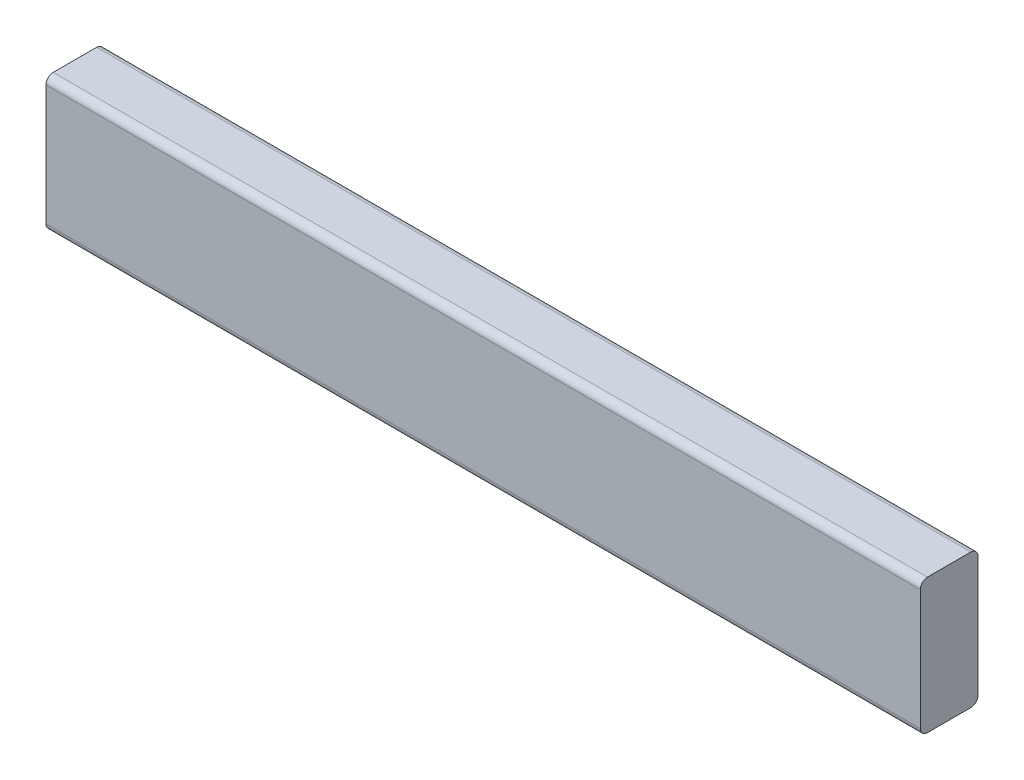
ISO-10303-21;
HEADER;
FILE_DESCRIPTION(('STEP AP214'),'2;1');
FILE_NAME('part.step','',(''),(''),'','','');
FILE_SCHEMA(('AUTOMOTIVE_DESIGN { 1 0 10303 214 1 1 1 1 }'));
ENDSEC;
DATA;
#1=APPLICATION_CONTEXT('core data for automotive mechanical design processes');
#2=APPLICATION_PROTOCOL_DEFINITION('international standard','automotive_design',2000,#1);
#3=PRODUCT_CONTEXT('',#1,'mechanical');
#4=PRODUCT('Part','Part','',(#3));
#5=PRODUCT_RELATED_PRODUCT_CATEGORY('part','',(#4));
#6=PRODUCT_DEFINITION_FORMATION('','',#4);
#7=PRODUCT_DEFINITION_CONTEXT('part definition',#1,'design');
#8=PRODUCT_DEFINITION('design','',#6,#7);
#9=PRODUCT_DEFINITION_SHAPE('','',#8);
#10=(LENGTH_UNIT() NAMED_UNIT(*) SI_UNIT(.MILLI.,.METRE.));
#11=(NAMED_UNIT(*) PLANE_ANGLE_UNIT() SI_UNIT($,.RADIAN.));
#12=(NAMED_UNIT(*) SI_UNIT($,.STERADIAN.) SOLID_ANGLE_UNIT());
#13=UNCERTAINTY_MEASURE_WITH_UNIT(LENGTH_MEASURE(1.E-05),#10,'distance_accuracy_value','');
#14=(GEOMETRIC_REPRESENTATION_CONTEXT(3) GLOBAL_UNCERTAINTY_ASSIGNED_CONTEXT((#13)) GLOBAL_UNIT_ASSIGNED_CONTEXT((#10,
#11,#12)) REPRESENTATION_CONTEXT('',''));
#15=CARTESIAN_POINT('',(0.,0.,0.));
#16=DIRECTION('',(0.,0.,1.));
#17=DIRECTION('',(1.,0.,0.));
#18=AXIS2_PLACEMENT_3D('',#15,#16,#17);
#19=CARTESIAN_POINT('',(-781.730594650988,88.9,-621.709126043838));
#20=DIRECTION('',(-1.,0.,0.));
#21=DIRECTION('',(0.,0.,1.));
#22=AXIS2_PLACEMENT_3D('',#19,#20,#21);
#23=PLANE('',#22);
#24=DIRECTION('',(0.,1.,0.));
#25=VECTOR('',#24,1.);
#26=CARTESIAN_POINT('',(-781.730594651,88.8999999999999,-38.1000000000004));
#27=LINE('',#26,#25);
#28=CARTESIAN_POINT('',(-781.730594651,4.7625,-38.1000000000004));
#29=VERTEX_POINT('',#28);
#30=CARTESIAN_POINT('',(-781.730594651,84.1375,-38.1000000000004));
#31=VERTEX_POINT('',#30);
#32=EDGE_CURVE('E125',#29,#31,#27,.T.);
#33=ORIENTED_EDGE('',*,*,#32,.F.);
#34=CARTESIAN_POINT('',(-781.730594651,4.7625,-33.3375000000003));
#35=DIRECTION('',(-1.,0.,0.));
#36=DIRECTION('',(0.,0.,1.));
#37=AXIS2_PLACEMENT_3D('',#34,#35,#36);
#38=CIRCLE('',#37,4.7625);
#39=CARTESIAN_POINT('',(-781.730594651,0.,-33.3375000000004));
#40=VERTEX_POINT('',#39);
#41=EDGE_CURVE('E106',#29,#40,#38,.T.);
#42=ORIENTED_EDGE('',*,*,#41,.T.);
#43=DIRECTION('',(0.,0.,1.));
#44=VECTOR('',#43,1.);
#45=CARTESIAN_POINT('',(-781.730594650988,0.,-621.709126043838));
#46=LINE('',#45,#44);
#47=CARTESIAN_POINT('',(-781.730594651,0.,-4.7625));
#48=VERTEX_POINT('',#47);
#49=EDGE_CURVE('E152',#40,#48,#46,.T.);
#50=ORIENTED_EDGE('',*,*,#49,.T.);
#51=CARTESIAN_POINT('',(-781.730594651,4.7625,-4.7625));
#52=DIRECTION('',(-1.,0.,0.));
#53=DIRECTION('',(0.,0.,1.));
#54=AXIS2_PLACEMENT_3D('',#51,#52,#53);
#55=CIRCLE('',#54,4.7625);
#56=CARTESIAN_POINT('',(-781.730594651,4.7625,0.));
#57=VERTEX_POINT('',#56);
#58=EDGE_CURVE('E118',#48,#57,#55,.T.);
#59=ORIENTED_EDGE('',*,*,#58,.T.);
#60=DIRECTION('',(0.,-1.,0.));
#61=VECTOR('',#60,1.);
#62=CARTESIAN_POINT('',(-781.730594651,88.9,0.));
#63=LINE('',#62,#61);
#64=CARTESIAN_POINT('',(-781.730594651,84.1375,0.));
#65=VERTEX_POINT('',#64);
#66=EDGE_CURVE('E145',#65,#57,#63,.T.);
#67=ORIENTED_EDGE('',*,*,#66,.F.);
#68=CARTESIAN_POINT('',(-781.730594651,84.1375,-4.7625));
#69=DIRECTION('',(-1.,0.,0.));
#70=DIRECTION('',(0.,0.,1.));
#71=AXIS2_PLACEMENT_3D('',#68,#69,#70);
#72=CIRCLE('',#71,4.7625);
#73=CARTESIAN_POINT('',(-781.730594651,88.9,-4.7625));
#74=VERTEX_POINT('',#73);
#75=EDGE_CURVE('E130',#65,#74,#72,.T.);
#76=ORIENTED_EDGE('',*,*,#75,.T.);
#77=DIRECTION('',(0.,0.,1.));
#78=VECTOR('',#77,1.);
#79=CARTESIAN_POINT('',(-781.730594650988,88.9,-621.709126043838));
#80=LINE('',#79,#78);
#81=CARTESIAN_POINT('',(-781.730594651,88.9,-33.3375000000004));
#82=VERTEX_POINT('',#81);
#83=EDGE_CURVE('E142',#82,#74,#80,.T.);
#84=ORIENTED_EDGE('',*,*,#83,.F.);
#85=CARTESIAN_POINT('',(-781.730594651,84.1375,-33.3375000000003));
#86=DIRECTION('',(-1.,0.,0.));
#87=DIRECTION('',(0.,0.,1.));
#88=AXIS2_PLACEMENT_3D('',#85,#86,#87);
#89=CIRCLE('',#88,4.7625);
#90=EDGE_CURVE('E135',#82,#31,#89,.T.);
#91=ORIENTED_EDGE('',*,*,#90,.T.);
#92=EDGE_LOOP('',(#33,#42,#50,#59,#67,#76,#84,#91));
#93=FACE_BOUND('',#92,.T.);
#94=ADVANCED_FACE('F38',(#93),#23,.T.);
#95=CARTESIAN_POINT('',(-781.730594650988,88.9,-621.709126043838));
#96=DIRECTION('',(0.,1.,0.));
#97=DIRECTION('',(0.,0.,1.));
#98=AXIS2_PLACEMENT_3D('',#95,#96,#97);
#99=PLANE('',#98);
#100=DIRECTION('',(0.,0.,1.));
#101=VECTOR('',#100,1.);
#102=CARTESIAN_POINT('',(-204.932187925,88.9,-621.709126043838));
#103=LINE('',#102,#101);
#104=CARTESIAN_POINT('',(-204.932187925,88.9,-33.3375000000004));
#105=VERTEX_POINT('',#104);
#106=CARTESIAN_POINT('',(-204.932187925,88.9,-4.7625));
#107=VERTEX_POINT('',#106);
#108=EDGE_CURVE('E156',#105,#107,#103,.T.);
#109=ORIENTED_EDGE('',*,*,#108,.F.);
#110=DIRECTION('',(1.,0.,0.));
#111=VECTOR('',#110,1.);
#112=CARTESIAN_POINT('',(-781.730594651,88.9,-33.3375000000003));
#113=LINE('',#112,#111);
#114=EDGE_CURVE('E11',#105,#82,#113,.F.);
#115=ORIENTED_EDGE('',*,*,#114,.T.);
#116=ORIENTED_EDGE('',*,*,#83,.T.);
#117=DIRECTION('',(-1.,0.,0.));
#118=VECTOR('',#117,1.);
#119=CARTESIAN_POINT('',(-781.730594651,88.9,-4.7625));
#120=LINE('',#119,#118);
#121=EDGE_CURVE('E47',#74,#107,#120,.F.);
#122=ORIENTED_EDGE('',*,*,#121,.T.);
#123=EDGE_LOOP('',(#109,#115,#116,#122));
#124=FACE_BOUND('',#123,.T.);
#125=ADVANCED_FACE('F196',(#124),#99,.T.);
#126=CARTESIAN_POINT('',(-204.932187925,88.9,-621.709126043838));
#127=DIRECTION('',(1.,0.,0.));
#128=DIRECTION('',(0.,0.,-1.));
#129=AXIS2_PLACEMENT_3D('',#126,#127,#128);
#130=PLANE('',#129);
#131=DIRECTION('',(0.,0.,1.));
#132=VECTOR('',#131,1.);
#133=CARTESIAN_POINT('',(-204.932187925,0.,-621.709126043838));
#134=LINE('',#133,#132);
#135=CARTESIAN_POINT('',(-204.932187925,0.,-33.3375000000004));
#136=VERTEX_POINT('',#135);
#137=CARTESIAN_POINT('',(-204.932187925,0.,-4.7625));
#138=VERTEX_POINT('',#137);
#139=EDGE_CURVE('E159',#136,#138,#134,.T.);
#140=ORIENTED_EDGE('',*,*,#139,.F.);
#141=CARTESIAN_POINT('',(-204.932187925,4.7625,-33.3375000000004));
#142=DIRECTION('',(1.,0.,0.));
#143=DIRECTION('',(0.,0.,-1.));
#144=AXIS2_PLACEMENT_3D('',#141,#142,#143);
#145=CIRCLE('',#144,4.7625);
#146=CARTESIAN_POINT('',(-204.932187925,4.7625,-38.1000000000004));
#147=VERTEX_POINT('',#146);
#148=EDGE_CURVE('E182',#136,#147,#145,.T.);
#149=ORIENTED_EDGE('',*,*,#148,.T.);
#150=DIRECTION('',(0.,-1.,0.));
#151=VECTOR('',#150,1.);
#152=CARTESIAN_POINT('',(-204.932187925,88.8999999999999,-38.1000000000004));
#153=LINE('',#152,#151);
#154=CARTESIAN_POINT('',(-204.932187925,84.1375,-38.1000000000004));
#155=VERTEX_POINT('',#154);
#156=EDGE_CURVE('E128',#155,#147,#153,.T.);
#157=ORIENTED_EDGE('',*,*,#156,.F.);
#158=CARTESIAN_POINT('',(-204.932187925,84.1375,-33.3375000000004));
#159=DIRECTION('',(1.,0.,0.));
#160=DIRECTION('',(0.,0.,-1.));
#161=AXIS2_PLACEMENT_3D('',#158,#159,#160);
#162=CIRCLE('',#161,4.7625);
#163=EDGE_CURVE('E177',#155,#105,#162,.T.);
#164=ORIENTED_EDGE('',*,*,#163,.T.);
#165=ORIENTED_EDGE('',*,*,#108,.T.);
#166=CARTESIAN_POINT('',(-204.932187925,84.1375,-4.7625));
#167=DIRECTION('',(1.,0.,0.));
#168=DIRECTION('',(0.,0.,-1.));
#169=AXIS2_PLACEMENT_3D('',#166,#167,#168);
#170=CIRCLE('',#169,4.7625);
#171=CARTESIAN_POINT('',(-204.932187925,84.1375,0.));
#172=VERTEX_POINT('',#171);
#173=EDGE_CURVE('E54',#107,#172,#170,.T.);
#174=ORIENTED_EDGE('',*,*,#173,.T.);
#175=DIRECTION('',(0.,1.,0.));
#176=VECTOR('',#175,1.);
#177=CARTESIAN_POINT('',(-204.932187925,88.9,0.));
#178=LINE('',#177,#176);
#179=CARTESIAN_POINT('',(-204.932187925,4.7625,0.));
#180=VERTEX_POINT('',#179);
#181=EDGE_CURVE('E149',#180,#172,#178,.T.);
#182=ORIENTED_EDGE('',*,*,#181,.F.);
#183=CARTESIAN_POINT('',(-204.932187925,4.7625,-4.7625));
#184=DIRECTION('',(1.,0.,0.));
#185=DIRECTION('',(0.,0.,-1.));
#186=AXIS2_PLACEMENT_3D('',#183,#184,#185);
#187=CIRCLE('',#186,4.7625);
#188=EDGE_CURVE('E62',#180,#138,#187,.T.);
#189=ORIENTED_EDGE('',*,*,#188,.T.);
#190=EDGE_LOOP('',(#140,#149,#157,#164,#165,#174,#182,#189));
#191=FACE_BOUND('',#190,.T.);
#192=ADVANCED_FACE('F200',(#191),#130,.T.);
#193=CARTESIAN_POINT('',(-781.730594650988,0.,-621.709126043838));
#194=DIRECTION('',(0.,-1.,0.));
#195=DIRECTION('',(0.,0.,-1.));
#196=AXIS2_PLACEMENT_3D('',#193,#194,#195);
#197=PLANE('',#196);
#198=ORIENTED_EDGE('',*,*,#49,.F.);
#199=DIRECTION('',(-1.,0.,0.));
#200=VECTOR('',#199,1.);
#201=CARTESIAN_POINT('',(-204.932187925,0.,-33.3375000000004));
#202=LINE('',#201,#200);
#203=EDGE_CURVE('E111',#40,#136,#202,.F.);
#204=ORIENTED_EDGE('',*,*,#203,.T.);
#205=ORIENTED_EDGE('',*,*,#139,.T.);
#206=DIRECTION('',(1.,0.,0.));
#207=VECTOR('',#206,1.);
#208=CARTESIAN_POINT('',(-781.730594651,0.,-4.7625));
#209=LINE('',#208,#207);
#210=EDGE_CURVE('E117',#138,#48,#209,.F.);
#211=ORIENTED_EDGE('',*,*,#210,.T.);
#212=EDGE_LOOP('',(#198,#204,#205,#211));
#213=FACE_BOUND('',#212,.T.);
#214=ADVANCED_FACE('F208',(#213),#197,.T.);
#215=CARTESIAN_POINT('',(0.,0.,0.));
#216=DIRECTION('',(0.,0.,1.));
#217=DIRECTION('',(1.,0.,0.));
#218=AXIS2_PLACEMENT_3D('',#215,#216,#217);
#219=PLANE('',#218);
#220=ORIENTED_EDGE('',*,*,#66,.T.);
#221=DIRECTION('',(1.,0.,0.));
#222=VECTOR('',#221,1.);
#223=CARTESIAN_POINT('',(0.,4.7625,0.));
#224=LINE('',#223,#222);
#225=EDGE_CURVE('E189',#57,#180,#224,.T.);
#226=ORIENTED_EDGE('',*,*,#225,.T.);
#227=ORIENTED_EDGE('',*,*,#181,.T.);
#228=DIRECTION('',(-1.,0.,0.));
#229=VECTOR('',#228,1.);
#230=CARTESIAN_POINT('',(0.,84.1375,0.));
#231=LINE('',#230,#229);
#232=EDGE_CURVE('E185',#172,#65,#231,.T.);
#233=ORIENTED_EDGE('',*,*,#232,.T.);
#234=EDGE_LOOP('',(#220,#226,#227,#233));
#235=FACE_BOUND('',#234,.T.);
#236=ADVANCED_FACE('F204',(#235),#219,.T.);
#237=CARTESIAN_POINT('',(-204.932187925,1473.2,-38.1000000000002));
#238=DIRECTION('',(0.,0.,1.));
#239=DIRECTION('',(0.,1.,0.));
#240=AXIS2_PLACEMENT_3D('',#237,#238,#239);
#241=PLANE('',#240);
#242=ORIENTED_EDGE('',*,*,#156,.T.);
#243=DIRECTION('',(-1.,0.,0.));
#244=VECTOR('',#243,1.);
#245=CARTESIAN_POINT('',(-781.730594651,4.7625,-38.1000000000003));
#246=LINE('',#245,#244);
#247=EDGE_CURVE('E110',#147,#29,#246,.T.);
#248=ORIENTED_EDGE('',*,*,#247,.T.);
#249=ORIENTED_EDGE('',*,*,#32,.T.);
#250=DIRECTION('',(1.,0.,0.));
#251=VECTOR('',#250,1.);
#252=CARTESIAN_POINT('',(-204.932187925,84.1375,-38.1000000000004));
#253=LINE('',#252,#251);
#254=EDGE_CURVE('E131',#31,#155,#253,.T.);
#255=ORIENTED_EDGE('',*,*,#254,.T.);
#256=EDGE_LOOP('',(#242,#248,#249,#255));
#257=FACE_BOUND('',#256,.T.);
#258=ADVANCED_FACE('F123',(#257),#241,.F.);
#259=CARTESIAN_POINT('',(-204.932187925,4.7625,-33.3375000000004));
#260=DIRECTION('',(1.,0.,0.));
#261=DIRECTION('',(0.,0.,-1.));
#262=AXIS2_PLACEMENT_3D('',#259,#260,#261);
#263=CYLINDRICAL_SURFACE('',#262,4.7625);
#264=ORIENTED_EDGE('',*,*,#148,.F.);
#265=ORIENTED_EDGE('',*,*,#203,.F.);
#266=ORIENTED_EDGE('',*,*,#41,.F.);
#267=ORIENTED_EDGE('',*,*,#247,.F.);
#268=EDGE_LOOP('',(#264,#265,#266,#267));
#269=FACE_BOUND('',#268,.T.);
#270=ADVANCED_FACE('F109',(#269),#263,.T.);
#271=CARTESIAN_POINT('',(0.,4.7625,-4.7625));
#272=DIRECTION('',(1.,0.,0.));
#273=DIRECTION('',(0.,0.,-1.));
#274=AXIS2_PLACEMENT_3D('',#271,#272,#273);
#275=CYLINDRICAL_SURFACE('',#274,4.7625);
#276=ORIENTED_EDGE('',*,*,#58,.F.);
#277=ORIENTED_EDGE('',*,*,#210,.F.);
#278=ORIENTED_EDGE('',*,*,#188,.F.);
#279=ORIENTED_EDGE('',*,*,#225,.F.);
#280=EDGE_LOOP('',(#276,#277,#278,#279));
#281=FACE_BOUND('',#280,.T.);
#282=ADVANCED_FACE('F206',(#281),#275,.T.);
#283=CARTESIAN_POINT('',(-204.932187925,84.1375,-33.3375000000004));
#284=DIRECTION('',(-1.,0.,0.));
#285=DIRECTION('',(0.,0.,1.));
#286=AXIS2_PLACEMENT_3D('',#283,#284,#285);
#287=CYLINDRICAL_SURFACE('',#286,4.7625);
#288=ORIENTED_EDGE('',*,*,#90,.F.);
#289=ORIENTED_EDGE('',*,*,#114,.F.);
#290=ORIENTED_EDGE('',*,*,#163,.F.);
#291=ORIENTED_EDGE('',*,*,#254,.F.);
#292=EDGE_LOOP('',(#288,#289,#290,#291));
#293=FACE_BOUND('',#292,.T.);
#294=ADVANCED_FACE('F227',(#293),#287,.T.);
#295=CARTESIAN_POINT('',(0.,84.1375,-4.7625));
#296=DIRECTION('',(-1.,0.,0.));
#297=DIRECTION('',(0.,0.,1.));
#298=AXIS2_PLACEMENT_3D('',#295,#296,#297);
#299=CYLINDRICAL_SURFACE('',#298,4.7625);
#300=ORIENTED_EDGE('',*,*,#173,.F.);
#301=ORIENTED_EDGE('',*,*,#121,.F.);
#302=ORIENTED_EDGE('',*,*,#75,.F.);
#303=ORIENTED_EDGE('',*,*,#232,.F.);
#304=EDGE_LOOP('',(#300,#301,#302,#303));
#305=FACE_BOUND('',#304,.T.);
#306=ADVANCED_FACE('F40',(#305),#299,.T.);
#307=CLOSED_SHELL('',(#94,#125,#192,#214,#236,#258,#270,#282,#294,#306));
#308=MANIFOLD_SOLID_BREP('B2',#307);
#309=ADVANCED_BREP_SHAPE_REPRESENTATION('',(#18,#308),#14);
#310=SHAPE_DEFINITION_REPRESENTATION(#9,#309);
ENDSEC;
END-ISO-10303-21;
